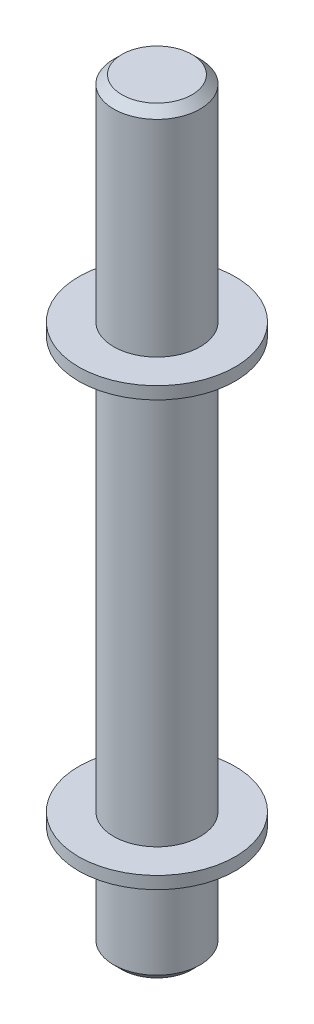
ISO-10303-21;
HEADER;
FILE_DESCRIPTION(('STEP AP214'),'2;1');
FILE_NAME('part.step','',(''),(''),'','','');
FILE_SCHEMA(('AUTOMOTIVE_DESIGN { 1 0 10303 214 1 1 1 1 }'));
ENDSEC;
DATA;
#1=APPLICATION_CONTEXT('core data for automotive mechanical design processes');
#2=APPLICATION_PROTOCOL_DEFINITION('international standard','automotive_design',2000,#1);
#3=PRODUCT_CONTEXT('',#1,'mechanical');
#4=PRODUCT('Part','Part','',(#3));
#5=PRODUCT_RELATED_PRODUCT_CATEGORY('part','',(#4));
#6=PRODUCT_DEFINITION_FORMATION('','',#4);
#7=PRODUCT_DEFINITION_CONTEXT('part definition',#1,'design');
#8=PRODUCT_DEFINITION('design','',#6,#7);
#9=PRODUCT_DEFINITION_SHAPE('','',#8);
#10=(LENGTH_UNIT() NAMED_UNIT(*) SI_UNIT(.MILLI.,.METRE.));
#11=(NAMED_UNIT(*) PLANE_ANGLE_UNIT() SI_UNIT($,.RADIAN.));
#12=(NAMED_UNIT(*) SI_UNIT($,.STERADIAN.) SOLID_ANGLE_UNIT());
#13=UNCERTAINTY_MEASURE_WITH_UNIT(LENGTH_MEASURE(1.E-05),#10,'distance_accuracy_value','');
#14=(GEOMETRIC_REPRESENTATION_CONTEXT(3) GLOBAL_UNCERTAINTY_ASSIGNED_CONTEXT((#13)) GLOBAL_UNIT_ASSIGNED_CONTEXT((#10,
#11,#12)) REPRESENTATION_CONTEXT('',''));
#15=CARTESIAN_POINT('',(0.,0.,0.));
#16=DIRECTION('',(0.,0.,1.));
#17=DIRECTION('',(1.,0.,0.));
#18=AXIS2_PLACEMENT_3D('',#15,#16,#17);
#19=CARTESIAN_POINT('',(0.,26.,0.));
#20=DIRECTION('',(0.,-1.,0.));
#21=DIRECTION('',(0.,0.,-1.));
#22=AXIS2_PLACEMENT_3D('',#19,#20,#21);
#23=CYLINDRICAL_SURFACE('',#22,10.5);
#24=CARTESIAN_POINT('',(0.,2.00000000000007,0.));
#25=DIRECTION('',(0.,1.,0.));
#26=DIRECTION('',(0.,0.,1.));
#27=AXIS2_PLACEMENT_3D('',#24,#25,#26);
#28=CIRCLE('',#27,10.5);
#29=CARTESIAN_POINT('',(0.,2.00000000000007,10.5));
#30=VERTEX_POINT('',#29);
#31=EDGE_CURVE('E67',#30,#30,#28,.T.);
#32=ORIENTED_EDGE('',*,*,#31,.T.);
#33=EDGE_LOOP('',(#32));
#34=FACE_BOUND('',#33,.T.);
#35=CARTESIAN_POINT('',(0.,26.,0.));
#36=DIRECTION('',(0.,1.,0.));
#37=DIRECTION('',(0.,0.,1.));
#38=AXIS2_PLACEMENT_3D('',#35,#36,#37);
#39=CIRCLE('',#38,10.5);
#40=CARTESIAN_POINT('',(0.,26.,10.5));
#41=VERTEX_POINT('',#40);
#42=EDGE_CURVE('E73',#41,#41,#39,.T.);
#43=ORIENTED_EDGE('',*,*,#42,.F.);
#44=EDGE_LOOP('',(#43));
#45=FACE_BOUND('',#44,.T.);
#46=ADVANCED_FACE('F51',(#34,#45),#23,.T.);
#47=CARTESIAN_POINT('',(0.,0.,0.));
#48=DIRECTION('',(0.,1.,0.));
#49=DIRECTION('',(0.,0.,1.));
#50=AXIS2_PLACEMENT_3D('',#47,#48,#49);
#51=PLANE('',#50);
#52=CARTESIAN_POINT('',(0.,0.,0.));
#53=DIRECTION('',(0.,1.,0.));
#54=DIRECTION('',(0.,0.,1.));
#55=AXIS2_PLACEMENT_3D('',#52,#53,#54);
#56=CIRCLE('',#55,8.49999999999992);
#57=CARTESIAN_POINT('',(0.,0.,8.49999999999992));
#58=VERTEX_POINT('',#57);
#59=EDGE_CURVE('E63',#58,#58,#56,.F.);
#60=ORIENTED_EDGE('',*,*,#59,.T.);
#61=EDGE_LOOP('',(#60));
#62=FACE_BOUND('',#61,.T.);
#63=ADVANCED_FACE('F122',(#62),#51,.F.);
#64=CARTESIAN_POINT('',(0.,29.,0.));
#65=DIRECTION('',(0.,-1.,0.));
#66=DIRECTION('',(0.,0.,-1.));
#67=AXIS2_PLACEMENT_3D('',#64,#65,#66);
#68=CYLINDRICAL_SURFACE('',#67,19.);
#69=CARTESIAN_POINT('',(0.,29.,0.));
#70=DIRECTION('',(0.,1.,0.));
#71=DIRECTION('',(0.,0.,1.));
#72=AXIS2_PLACEMENT_3D('',#69,#70,#71);
#73=CIRCLE('',#72,19.);
#74=CARTESIAN_POINT('',(0.,29.,19.));
#75=VERTEX_POINT('',#74);
#76=EDGE_CURVE('E77',#75,#75,#73,.T.);
#77=ORIENTED_EDGE('',*,*,#76,.F.);
#78=EDGE_LOOP('',(#77));
#79=FACE_BOUND('',#78,.T.);
#80=CARTESIAN_POINT('',(0.,26.,0.));
#81=DIRECTION('',(0.,1.,0.));
#82=DIRECTION('',(0.,0.,1.));
#83=AXIS2_PLACEMENT_3D('',#80,#81,#82);
#84=CIRCLE('',#83,19.);
#85=CARTESIAN_POINT('',(0.,26.,19.));
#86=VERTEX_POINT('',#85);
#87=EDGE_CURVE('E78',#86,#86,#84,.T.);
#88=ORIENTED_EDGE('',*,*,#87,.T.);
#89=EDGE_LOOP('',(#88));
#90=FACE_BOUND('',#89,.T.);
#91=ADVANCED_FACE('F128',(#79,#90),#68,.T.);
#92=CARTESIAN_POINT('',(0.,29.,0.));
#93=DIRECTION('',(0.,1.,0.));
#94=DIRECTION('',(0.,0.,1.));
#95=AXIS2_PLACEMENT_3D('',#92,#93,#94);
#96=PLANE('',#95);
#97=CARTESIAN_POINT('',(0.,29.,0.));
#98=DIRECTION('',(0.,1.,0.));
#99=DIRECTION('',(0.,0.,1.));
#100=AXIS2_PLACEMENT_3D('',#97,#98,#99);
#101=CIRCLE('',#100,10.5);
#102=CARTESIAN_POINT('',(0.,29.,10.5));
#103=VERTEX_POINT('',#102);
#104=EDGE_CURVE('E76',#103,#103,#101,.T.);
#105=ORIENTED_EDGE('',*,*,#104,.F.);
#106=EDGE_LOOP('',(#105));
#107=FACE_BOUND('',#106,.T.);
#108=ORIENTED_EDGE('',*,*,#76,.T.);
#109=EDGE_LOOP('',(#108));
#110=FACE_BOUND('',#109,.T.);
#111=ADVANCED_FACE('F221',(#107,#110),#96,.T.);
#112=CARTESIAN_POINT('',(0.,26.,0.));
#113=DIRECTION('',(0.,1.,0.));
#114=DIRECTION('',(0.,0.,1.));
#115=AXIS2_PLACEMENT_3D('',#112,#113,#114);
#116=PLANE('',#115);
#117=ORIENTED_EDGE('',*,*,#42,.T.);
#118=EDGE_LOOP('',(#117));
#119=FACE_BOUND('',#118,.T.);
#120=ORIENTED_EDGE('',*,*,#87,.F.);
#121=EDGE_LOOP('',(#120));
#122=FACE_BOUND('',#121,.T.);
#123=ADVANCED_FACE('F211',(#119,#122),#116,.F.);
#124=CARTESIAN_POINT('',(0.,129.,0.));
#125=DIRECTION('',(0.,-1.,0.));
#126=DIRECTION('',(0.,0.,-1.));
#127=AXIS2_PLACEMENT_3D('',#124,#125,#126);
#128=CYLINDRICAL_SURFACE('',#127,10.5);
#129=CARTESIAN_POINT('',(0.,129.,0.));
#130=DIRECTION('',(0.,1.,0.));
#131=DIRECTION('',(0.,0.,1.));
#132=AXIS2_PLACEMENT_3D('',#129,#130,#131);
#133=CIRCLE('',#132,10.5);
#134=CARTESIAN_POINT('',(0.,129.,10.5));
#135=VERTEX_POINT('',#134);
#136=EDGE_CURVE('E81',#135,#135,#133,.T.);
#137=ORIENTED_EDGE('',*,*,#136,.F.);
#138=EDGE_LOOP('',(#137));
#139=FACE_BOUND('',#138,.T.);
#140=ORIENTED_EDGE('',*,*,#104,.T.);
#141=EDGE_LOOP('',(#140));
#142=FACE_BOUND('',#141,.T.);
#143=ADVANCED_FACE('F109',(#139,#142),#128,.T.);
#144=CARTESIAN_POINT('',(0.,132.,0.));
#145=DIRECTION('',(0.,-1.,0.));
#146=DIRECTION('',(0.,0.,-1.));
#147=AXIS2_PLACEMENT_3D('',#144,#145,#146);
#148=CYLINDRICAL_SURFACE('',#147,19.);
#149=CARTESIAN_POINT('',(0.,132.,0.));
#150=DIRECTION('',(0.,1.,0.));
#151=DIRECTION('',(0.,0.,1.));
#152=AXIS2_PLACEMENT_3D('',#149,#150,#151);
#153=CIRCLE('',#152,19.);
#154=CARTESIAN_POINT('',(0.,132.,19.));
#155=VERTEX_POINT('',#154);
#156=EDGE_CURVE('E88',#155,#155,#153,.T.);
#157=ORIENTED_EDGE('',*,*,#156,.F.);
#158=EDGE_LOOP('',(#157));
#159=FACE_BOUND('',#158,.T.);
#160=CARTESIAN_POINT('',(0.,129.,0.));
#161=DIRECTION('',(0.,1.,0.));
#162=DIRECTION('',(0.,0.,1.));
#163=AXIS2_PLACEMENT_3D('',#160,#161,#162);
#164=CIRCLE('',#163,19.);
#165=CARTESIAN_POINT('',(0.,129.,19.));
#166=VERTEX_POINT('',#165);
#167=EDGE_CURVE('E89',#166,#166,#164,.T.);
#168=ORIENTED_EDGE('',*,*,#167,.T.);
#169=EDGE_LOOP('',(#168));
#170=FACE_BOUND('',#169,.T.);
#171=ADVANCED_FACE('F103',(#159,#170),#148,.T.);
#172=CARTESIAN_POINT('',(0.,132.,0.));
#173=DIRECTION('',(0.,1.,0.));
#174=DIRECTION('',(0.,0.,1.));
#175=AXIS2_PLACEMENT_3D('',#172,#173,#174);
#176=PLANE('',#175);
#177=CARTESIAN_POINT('',(0.,132.,0.));
#178=DIRECTION('',(0.,1.,0.));
#179=DIRECTION('',(0.,0.,1.));
#180=AXIS2_PLACEMENT_3D('',#177,#178,#179);
#181=CIRCLE('',#180,10.5);
#182=CARTESIAN_POINT('',(0.,132.,10.5));
#183=VERTEX_POINT('',#182);
#184=EDGE_CURVE('E72',#183,#183,#181,.T.);
#185=ORIENTED_EDGE('',*,*,#184,.F.);
#186=EDGE_LOOP('',(#185));
#187=FACE_BOUND('',#186,.T.);
#188=ORIENTED_EDGE('',*,*,#156,.T.);
#189=EDGE_LOOP('',(#188));
#190=FACE_BOUND('',#189,.T.);
#191=ADVANCED_FACE('F99',(#187,#190),#176,.T.);
#192=CARTESIAN_POINT('',(0.,129.,0.));
#193=DIRECTION('',(0.,1.,0.));
#194=DIRECTION('',(0.,0.,1.));
#195=AXIS2_PLACEMENT_3D('',#192,#193,#194);
#196=PLANE('',#195);
#197=ORIENTED_EDGE('',*,*,#136,.T.);
#198=EDGE_LOOP('',(#197));
#199=FACE_BOUND('',#198,.T.);
#200=ORIENTED_EDGE('',*,*,#167,.F.);
#201=EDGE_LOOP('',(#200));
#202=FACE_BOUND('',#201,.T.);
#203=ADVANCED_FACE('F102',(#199,#202),#196,.F.);
#204=CARTESIAN_POINT('',(0.,184.,0.));
#205=DIRECTION('',(0.,-1.,0.));
#206=DIRECTION('',(0.,0.,-1.));
#207=AXIS2_PLACEMENT_3D('',#204,#205,#206);
#208=CYLINDRICAL_SURFACE('',#207,10.5);
#209=CARTESIAN_POINT('',(0.,182.,0.));
#210=DIRECTION('',(0.,1.,0.));
#211=DIRECTION('',(0.,0.,1.));
#212=AXIS2_PLACEMENT_3D('',#209,#210,#211);
#213=CIRCLE('',#212,10.5);
#214=CARTESIAN_POINT('',(0.,182.,10.5));
#215=VERTEX_POINT('',#214);
#216=EDGE_CURVE('E10',#215,#215,#213,.F.);
#217=ORIENTED_EDGE('',*,*,#216,.T.);
#218=EDGE_LOOP('',(#217));
#219=FACE_BOUND('',#218,.T.);
#220=ORIENTED_EDGE('',*,*,#184,.T.);
#221=EDGE_LOOP('',(#220));
#222=FACE_BOUND('',#221,.T.);
#223=ADVANCED_FACE('F97',(#219,#222),#208,.T.);
#224=CARTESIAN_POINT('',(0.,184.,0.));
#225=DIRECTION('',(0.,1.,0.));
#226=DIRECTION('',(0.,0.,1.));
#227=AXIS2_PLACEMENT_3D('',#224,#225,#226);
#228=PLANE('',#227);
#229=CARTESIAN_POINT('',(0.,184.,0.));
#230=DIRECTION('',(0.,1.,0.));
#231=DIRECTION('',(0.,0.,1.));
#232=AXIS2_PLACEMENT_3D('',#229,#230,#231);
#233=CIRCLE('',#232,8.50000000000009);
#234=CARTESIAN_POINT('',(0.,184.,8.50000000000009));
#235=VERTEX_POINT('',#234);
#236=EDGE_CURVE('E59',#235,#235,#233,.T.);
#237=ORIENTED_EDGE('',*,*,#236,.T.);
#238=EDGE_LOOP('',(#237));
#239=FACE_BOUND('',#238,.T.);
#240=ADVANCED_FACE('F119',(#239),#228,.T.);
#241=CARTESIAN_POINT('',(0.,2.00000000000007,0.));
#242=DIRECTION('',(0.,1.,0.));
#243=DIRECTION('',(0.,0.,1.));
#244=AXIS2_PLACEMENT_3D('',#241,#242,#243);
#245=CONICAL_SURFACE('',#244,10.5,0.785398163397451);
#246=ORIENTED_EDGE('',*,*,#59,.F.);
#247=EDGE_LOOP('',(#246));
#248=FACE_BOUND('',#247,.T.);
#249=ORIENTED_EDGE('',*,*,#31,.F.);
#250=EDGE_LOOP('',(#249));
#251=FACE_BOUND('',#250,.T.);
#252=ADVANCED_FACE('F134',(#248,#251),#245,.T.);
#253=CARTESIAN_POINT('',(0.,184.,0.));
#254=DIRECTION('',(0.,-1.,0.));
#255=DIRECTION('',(0.,0.,-1.));
#256=AXIS2_PLACEMENT_3D('',#253,#254,#255);
#257=CONICAL_SURFACE('',#256,8.50000000000009,0.785398163397447);
#258=ORIENTED_EDGE('',*,*,#216,.F.);
#259=EDGE_LOOP('',(#258));
#260=FACE_BOUND('',#259,.T.);
#261=ORIENTED_EDGE('',*,*,#236,.F.);
#262=EDGE_LOOP('',(#261));
#263=FACE_BOUND('',#262,.T.);
#264=ADVANCED_FACE('F54',(#260,#263),#257,.T.);
#265=CLOSED_SHELL('',(#46,#63,#91,#111,#123,#143,#171,#191,#203,#223,#240,#252,#264));
#266=MANIFOLD_SOLID_BREP('B2',#265);
#267=ADVANCED_BREP_SHAPE_REPRESENTATION('',(#18,#266),#14);
#268=SHAPE_DEFINITION_REPRESENTATION(#9,#267);
ENDSEC;
END-ISO-10303-21;
